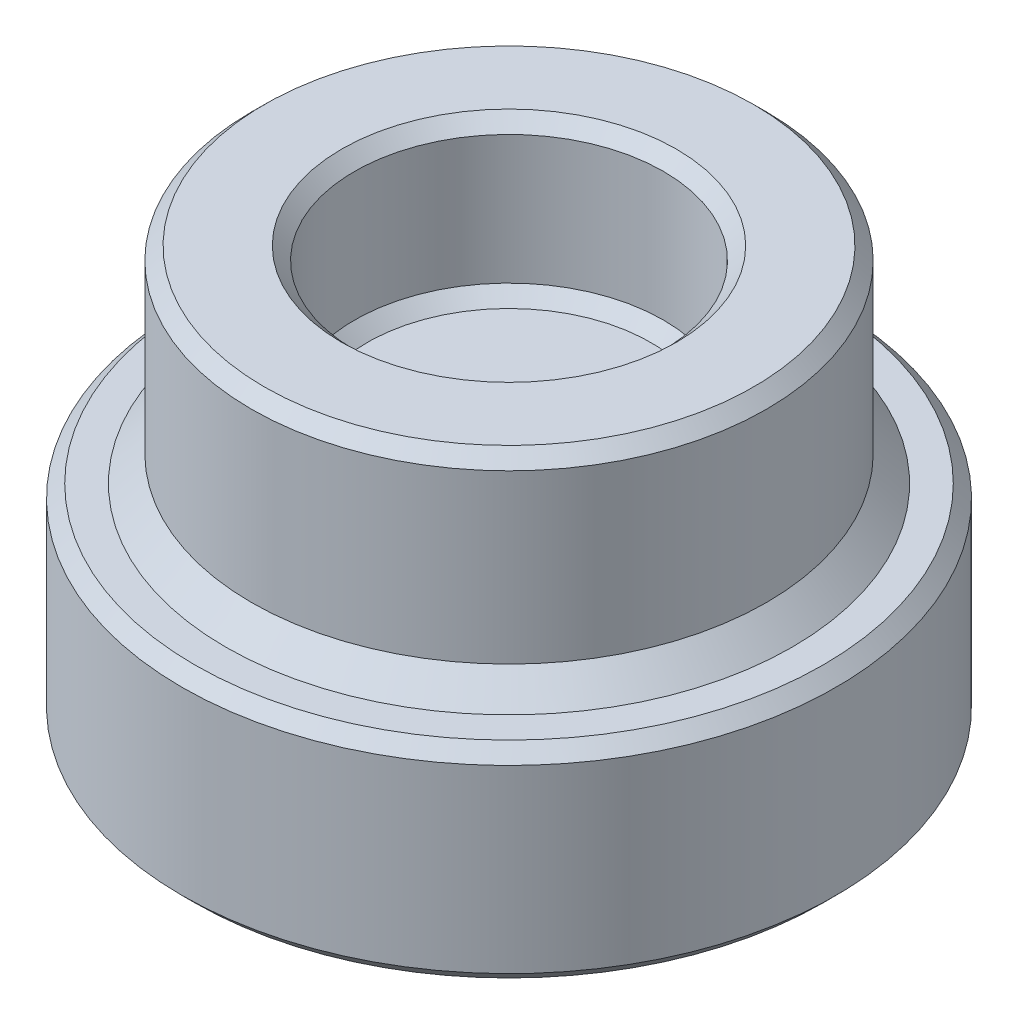
ISO-10303-21;
HEADER;
FILE_DESCRIPTION(('STEP AP214'),'2;1');
FILE_NAME('part.step','',(''),(''),'','','');
FILE_SCHEMA(('AUTOMOTIVE_DESIGN { 1 0 10303 214 1 1 1 1 }'));
ENDSEC;
DATA;
#1=APPLICATION_CONTEXT('core data for automotive mechanical design processes');
#2=APPLICATION_PROTOCOL_DEFINITION('international standard','automotive_design',2000,#1);
#3=PRODUCT_CONTEXT('',#1,'mechanical');
#4=PRODUCT('Part','Part','',(#3));
#5=PRODUCT_RELATED_PRODUCT_CATEGORY('part','',(#4));
#6=PRODUCT_DEFINITION_FORMATION('','',#4);
#7=PRODUCT_DEFINITION_CONTEXT('part definition',#1,'design');
#8=PRODUCT_DEFINITION('design','',#6,#7);
#9=PRODUCT_DEFINITION_SHAPE('','',#8);
#10=(LENGTH_UNIT() NAMED_UNIT(*) SI_UNIT(.MILLI.,.METRE.));
#11=(NAMED_UNIT(*) PLANE_ANGLE_UNIT() SI_UNIT($,.RADIAN.));
#12=(NAMED_UNIT(*) SI_UNIT($,.STERADIAN.) SOLID_ANGLE_UNIT());
#13=UNCERTAINTY_MEASURE_WITH_UNIT(LENGTH_MEASURE(1.E-05),#10,'distance_accuracy_value','');
#14=(GEOMETRIC_REPRESENTATION_CONTEXT(3) GLOBAL_UNCERTAINTY_ASSIGNED_CONTEXT((#13)) GLOBAL_UNIT_ASSIGNED_CONTEXT((#10,
#11,#12)) REPRESENTATION_CONTEXT('',''));
#15=CARTESIAN_POINT('',(0.,0.,0.));
#16=DIRECTION('',(0.,0.,1.));
#17=DIRECTION('',(1.,0.,0.));
#18=AXIS2_PLACEMENT_3D('',#15,#16,#17);
#19=CARTESIAN_POINT('',(0.,1.,0.));
#20=DIRECTION('',(0.,-1.,0.));
#21=DIRECTION('',(0.,0.,-1.));
#22=AXIS2_PLACEMENT_3D('',#19,#20,#21);
#23=CYLINDRICAL_SURFACE('',#22,5.);
#24=CARTESIAN_POINT('',(0.,0.499999999999998,0.));
#25=DIRECTION('',(0.,1.,0.));
#26=DIRECTION('',(0.,0.,1.));
#27=AXIS2_PLACEMENT_3D('',#24,#25,#26);
#28=CIRCLE('',#27,5.);
#29=CARTESIAN_POINT('',(0.,0.499999999999998,5.));
#30=VERTEX_POINT('',#29);
#31=EDGE_CURVE('E76',#30,#30,#28,.T.);
#32=ORIENTED_EDGE('',*,*,#31,.T.);
#33=EDGE_LOOP('',(#32));
#34=FACE_BOUND('',#33,.T.);
#35=CARTESIAN_POINT('',(0.,3.75,0.));
#36=DIRECTION('',(0.,1.,0.));
#37=DIRECTION('',(0.,0.,1.));
#38=AXIS2_PLACEMENT_3D('',#35,#36,#37);
#39=CIRCLE('',#38,5.);
#40=CARTESIAN_POINT('',(0.,3.75,5.));
#41=VERTEX_POINT('',#40);
#42=EDGE_CURVE('E114',#41,#41,#39,.F.);
#43=ORIENTED_EDGE('',*,*,#42,.T.);
#44=EDGE_LOOP('',(#43));
#45=FACE_BOUND('',#44,.T.);
#46=ADVANCED_FACE('F67',(#34,#45),#23,.T.);
#47=CARTESIAN_POINT('',(0.,4.,0.));
#48=DIRECTION('',(0.,1.,0.));
#49=DIRECTION('',(0.,0.,1.));
#50=AXIS2_PLACEMENT_3D('',#47,#48,#49);
#51=PLANE('',#50);
#52=CARTESIAN_POINT('',(0.,4.,0.));
#53=DIRECTION('',(0.,1.,0.));
#54=DIRECTION('',(0.,0.,1.));
#55=AXIS2_PLACEMENT_3D('',#52,#53,#54);
#56=CIRCLE('',#55,3.25);
#57=CARTESIAN_POINT('',(0.,4.,3.25));
#58=VERTEX_POINT('',#57);
#59=EDGE_CURVE('E110',#58,#58,#56,.F.);
#60=ORIENTED_EDGE('',*,*,#59,.T.);
#61=EDGE_LOOP('',(#60));
#62=FACE_BOUND('',#61,.T.);
#63=CARTESIAN_POINT('',(0.,4.,0.));
#64=DIRECTION('',(0.,1.,0.));
#65=DIRECTION('',(0.,0.,1.));
#66=AXIS2_PLACEMENT_3D('',#63,#64,#65);
#67=CIRCLE('',#66,4.75);
#68=CARTESIAN_POINT('',(0.,4.,4.75));
#69=VERTEX_POINT('',#68);
#70=EDGE_CURVE('E106',#69,#69,#67,.T.);
#71=ORIENTED_EDGE('',*,*,#70,.T.);
#72=EDGE_LOOP('',(#71));
#73=FACE_BOUND('',#72,.T.);
#74=ADVANCED_FACE('F154',(#62,#73),#51,.T.);
#75=CARTESIAN_POINT('',(0.,4.,0.));
#76=DIRECTION('',(0.,-1.,0.));
#77=DIRECTION('',(0.,0.,-1.));
#78=AXIS2_PLACEMENT_3D('',#75,#76,#77);
#79=CYLINDRICAL_SURFACE('',#78,3.);
#80=CARTESIAN_POINT('',(0.,3.75,0.));
#81=DIRECTION('',(0.,1.,0.));
#82=DIRECTION('',(0.,0.,1.));
#83=AXIS2_PLACEMENT_3D('',#80,#81,#82);
#84=CIRCLE('',#83,3.);
#85=CARTESIAN_POINT('',(0.,3.75,3.));
#86=VERTEX_POINT('',#85);
#87=EDGE_CURVE('E96',#86,#86,#84,.T.);
#88=ORIENTED_EDGE('',*,*,#87,.T.);
#89=EDGE_LOOP('',(#88));
#90=FACE_BOUND('',#89,.T.);
#91=CARTESIAN_POINT('',(0.,1.25,0.));
#92=DIRECTION('',(0.,1.,0.));
#93=DIRECTION('',(0.,0.,1.));
#94=AXIS2_PLACEMENT_3D('',#91,#92,#93);
#95=CIRCLE('',#94,3.);
#96=CARTESIAN_POINT('',(0.,1.25,3.));
#97=VERTEX_POINT('',#96);
#98=EDGE_CURVE('E90',#97,#97,#95,.F.);
#99=ORIENTED_EDGE('',*,*,#98,.T.);
#100=EDGE_LOOP('',(#99));
#101=FACE_BOUND('',#100,.T.);
#102=ADVANCED_FACE('F159',(#90,#101),#79,.F.);
#103=CARTESIAN_POINT('',(0.,1.,0.));
#104=DIRECTION('',(0.,1.,0.));
#105=DIRECTION('',(0.,0.,1.));
#106=AXIS2_PLACEMENT_3D('',#103,#104,#105);
#107=PLANE('',#106);
#108=CARTESIAN_POINT('',(0.,1.,0.));
#109=DIRECTION('',(0.,1.,0.));
#110=DIRECTION('',(0.,0.,1.));
#111=AXIS2_PLACEMENT_3D('',#108,#109,#110);
#112=CIRCLE('',#111,2.75);
#113=CARTESIAN_POINT('',(0.,1.,2.75));
#114=VERTEX_POINT('',#113);
#115=EDGE_CURVE('E118',#114,#114,#112,.T.);
#116=ORIENTED_EDGE('',*,*,#115,.T.);
#117=EDGE_LOOP('',(#116));
#118=FACE_BOUND('',#117,.T.);
#119=ADVANCED_FACE('F164',(#118),#107,.T.);
#120=CARTESIAN_POINT('',(0.,3.75,0.));
#121=DIRECTION('',(0.,1.,0.));
#122=DIRECTION('',(0.,0.,1.));
#123=AXIS2_PLACEMENT_3D('',#120,#121,#122);
#124=CONICAL_SURFACE('',#123,3.,0.785398163397455);
#125=ORIENTED_EDGE('',*,*,#59,.F.);
#126=EDGE_LOOP('',(#125));
#127=FACE_BOUND('',#126,.T.);
#128=ORIENTED_EDGE('',*,*,#87,.F.);
#129=EDGE_LOOP('',(#128));
#130=FACE_BOUND('',#129,.T.);
#131=ADVANCED_FACE('F166',(#127,#130),#124,.F.);
#132=CARTESIAN_POINT('',(0.,4.,0.));
#133=DIRECTION('',(0.,-1.,0.));
#134=DIRECTION('',(0.,0.,-1.));
#135=AXIS2_PLACEMENT_3D('',#132,#133,#134);
#136=CONICAL_SURFACE('',#135,4.75,0.785398163397441);
#137=ORIENTED_EDGE('',*,*,#42,.F.);
#138=EDGE_LOOP('',(#137));
#139=FACE_BOUND('',#138,.T.);
#140=ORIENTED_EDGE('',*,*,#70,.F.);
#141=EDGE_LOOP('',(#140));
#142=FACE_BOUND('',#141,.T.);
#143=ADVANCED_FACE('F172',(#139,#142),#136,.T.);
#144=CARTESIAN_POINT('',(0.,1.25,0.));
#145=DIRECTION('',(0.,1.,0.));
#146=DIRECTION('',(0.,0.,1.));
#147=AXIS2_PLACEMENT_3D('',#144,#145,#146);
#148=CONICAL_SURFACE('',#147,3.,0.785398163397443);
#149=ORIENTED_EDGE('',*,*,#115,.F.);
#150=EDGE_LOOP('',(#149));
#151=FACE_BOUND('',#150,.T.);
#152=ORIENTED_EDGE('',*,*,#98,.F.);
#153=EDGE_LOOP('',(#152));
#154=FACE_BOUND('',#153,.T.);
#155=ADVANCED_FACE('F179',(#151,#154),#148,.F.);
#156=CARTESIAN_POINT('',(0.,-4.,0.));
#157=DIRECTION('',(0.,1.,0.));
#158=DIRECTION('',(0.,0.,1.));
#159=AXIS2_PLACEMENT_3D('',#156,#157,#158);
#160=CYLINDRICAL_SURFACE('',#159,6.35);
#161=CARTESIAN_POINT('',(0.,-3.75,0.));
#162=DIRECTION('',(0.,1.,0.));
#163=DIRECTION('',(0.,0.,1.));
#164=AXIS2_PLACEMENT_3D('',#161,#162,#163);
#165=CIRCLE('',#164,6.35);
#166=CARTESIAN_POINT('',(0.,-3.75,6.35));
#167=VERTEX_POINT('',#166);
#168=EDGE_CURVE('E126',#167,#167,#165,.T.);
#169=ORIENTED_EDGE('',*,*,#168,.T.);
#170=EDGE_LOOP('',(#169));
#171=FACE_BOUND('',#170,.T.);
#172=CARTESIAN_POINT('',(0.,-0.249999999999996,0.));
#173=DIRECTION('',(0.,1.,0.));
#174=DIRECTION('',(0.,0.,1.));
#175=AXIS2_PLACEMENT_3D('',#172,#173,#174);
#176=CIRCLE('',#175,6.35);
#177=CARTESIAN_POINT('',(0.,-0.249999999999996,6.35));
#178=VERTEX_POINT('',#177);
#179=EDGE_CURVE('E122',#178,#178,#176,.F.);
#180=ORIENTED_EDGE('',*,*,#179,.T.);
#181=EDGE_LOOP('',(#180));
#182=FACE_BOUND('',#181,.T.);
#183=ADVANCED_FACE('F186',(#171,#182),#160,.T.);
#184=CARTESIAN_POINT('',(0.,-4.,0.));
#185=DIRECTION('',(0.,1.,0.));
#186=DIRECTION('',(0.,0.,1.));
#187=AXIS2_PLACEMENT_3D('',#184,#185,#186);
#188=PLANE('',#187);
#189=CARTESIAN_POINT('',(0.,-4.,0.));
#190=DIRECTION('',(0.,1.,0.));
#191=DIRECTION('',(0.,0.,1.));
#192=AXIS2_PLACEMENT_3D('',#189,#190,#191);
#193=CIRCLE('',#192,6.1);
#194=CARTESIAN_POINT('',(0.,-4.,6.1));
#195=VERTEX_POINT('',#194);
#196=EDGE_CURVE('E130',#195,#195,#193,.F.);
#197=ORIENTED_EDGE('',*,*,#196,.T.);
#198=EDGE_LOOP('',(#197));
#199=FACE_BOUND('',#198,.T.);
#200=CARTESIAN_POINT('',(0.,-4.,0.));
#201=DIRECTION('',(0.,-1.,0.));
#202=DIRECTION('',(0.,0.,-1.));
#203=AXIS2_PLACEMENT_3D('',#200,#201,#202);
#204=CIRCLE('',#203,3.125);
#205=CARTESIAN_POINT('',(0.,-4.,-3.125));
#206=VERTEX_POINT('',#205);
#207=EDGE_CURVE('E99',#206,#206,#204,.T.);
#208=ORIENTED_EDGE('',*,*,#207,.F.);
#209=EDGE_LOOP('',(#208));
#210=FACE_BOUND('',#209,.T.);
#211=ADVANCED_FACE('F210',(#199,#210),#188,.F.);
#212=CARTESIAN_POINT('',(0.,0.,0.));
#213=DIRECTION('',(0.,1.,0.));
#214=DIRECTION('',(0.,0.,1.));
#215=AXIS2_PLACEMENT_3D('',#212,#213,#214);
#216=PLANE('',#215);
#217=CARTESIAN_POINT('',(0.,0.,0.));
#218=DIRECTION('',(0.,1.,0.));
#219=DIRECTION('',(0.,0.,1.));
#220=AXIS2_PLACEMENT_3D('',#217,#218,#219);
#221=CIRCLE('',#220,5.49999999999999);
#222=CARTESIAN_POINT('',(0.,0.,5.49999999999999));
#223=VERTEX_POINT('',#222);
#224=EDGE_CURVE('E12',#223,#223,#221,.F.);
#225=ORIENTED_EDGE('',*,*,#224,.T.);
#226=EDGE_LOOP('',(#225));
#227=FACE_BOUND('',#226,.T.);
#228=CARTESIAN_POINT('',(0.,0.,0.));
#229=DIRECTION('',(0.,1.,0.));
#230=DIRECTION('',(0.,0.,1.));
#231=AXIS2_PLACEMENT_3D('',#228,#229,#230);
#232=CIRCLE('',#231,6.1);
#233=CARTESIAN_POINT('',(0.,0.,6.1));
#234=VERTEX_POINT('',#233);
#235=EDGE_CURVE('E134',#234,#234,#232,.T.);
#236=ORIENTED_EDGE('',*,*,#235,.T.);
#237=EDGE_LOOP('',(#236));
#238=FACE_BOUND('',#237,.T.);
#239=ADVANCED_FACE('F83',(#227,#238),#216,.T.);
#240=CARTESIAN_POINT('',(0.,-0.262465990577772,0.));
#241=DIRECTION('',(0.,-1.,0.));
#242=DIRECTION('',(0.,0.,-1.));
#243=AXIS2_PLACEMENT_3D('',#240,#241,#242);
#244=CONICAL_SURFACE('',#243,3.,1.48352986419518);
#245=CARTESIAN_POINT('',(0.,0.,0.));
#246=VERTEX_POINT('',#245);
#247=VERTEX_LOOP('',#246);
#248=FACE_BOUND('',#247,.T.);
#249=CARTESIAN_POINT('',(0.,-0.262465990577772,0.));
#250=DIRECTION('',(0.,-1.,0.));
#251=DIRECTION('',(0.,0.,-1.));
#252=AXIS2_PLACEMENT_3D('',#249,#250,#251);
#253=CIRCLE('',#252,3.);
#254=CARTESIAN_POINT('',(0.,-0.262465990577772,-3.));
#255=VERTEX_POINT('',#254);
#256=EDGE_CURVE('E87',#255,#255,#253,.T.);
#257=ORIENTED_EDGE('',*,*,#256,.T.);
#258=EDGE_LOOP('',(#257));
#259=FACE_BOUND('',#258,.T.);
#260=ADVANCED_FACE('F79',(#248,#259),#244,.F.);
#261=CARTESIAN_POINT('',(0.,-4.,0.));
#262=DIRECTION('',(0.,-1.,0.));
#263=DIRECTION('',(0.,0.,-1.));
#264=AXIS2_PLACEMENT_3D('',#261,#262,#263);
#265=CYLINDRICAL_SURFACE('',#264,3.);
#266=ORIENTED_EDGE('',*,*,#256,.F.);
#267=EDGE_LOOP('',(#266));
#268=FACE_BOUND('',#267,.T.);
#269=CARTESIAN_POINT('',(0.,-3.875,0.));
#270=DIRECTION('',(0.,-1.,0.));
#271=DIRECTION('',(0.,0.,-1.));
#272=AXIS2_PLACEMENT_3D('',#269,#270,#271);
#273=CIRCLE('',#272,3.);
#274=CARTESIAN_POINT('',(0.,-3.875,-3.));
#275=VERTEX_POINT('',#274);
#276=EDGE_CURVE('E91',#275,#275,#273,.T.);
#277=ORIENTED_EDGE('',*,*,#276,.T.);
#278=EDGE_LOOP('',(#277));
#279=FACE_BOUND('',#278,.T.);
#280=ADVANCED_FACE('F82',(#268,#279),#265,.F.);
#281=CARTESIAN_POINT('',(0.,-4.,0.));
#282=DIRECTION('',(0.,-1.,0.));
#283=DIRECTION('',(0.,0.,-1.));
#284=AXIS2_PLACEMENT_3D('',#281,#282,#283);
#285=CONICAL_SURFACE('',#284,3.125,0.785398163397452);
#286=ORIENTED_EDGE('',*,*,#276,.F.);
#287=EDGE_LOOP('',(#286));
#288=FACE_BOUND('',#287,.T.);
#289=ORIENTED_EDGE('',*,*,#207,.T.);
#290=EDGE_LOOP('',(#289));
#291=FACE_BOUND('',#290,.T.);
#292=ADVANCED_FACE('F192',(#288,#291),#285,.F.);
#293=CARTESIAN_POINT('',(0.,-3.75,0.));
#294=DIRECTION('',(0.,1.,0.));
#295=DIRECTION('',(0.,0.,1.));
#296=AXIS2_PLACEMENT_3D('',#293,#294,#295);
#297=CONICAL_SURFACE('',#296,6.35,0.785398163397448);
#298=ORIENTED_EDGE('',*,*,#196,.F.);
#299=EDGE_LOOP('',(#298));
#300=FACE_BOUND('',#299,.T.);
#301=ORIENTED_EDGE('',*,*,#168,.F.);
#302=EDGE_LOOP('',(#301));
#303=FACE_BOUND('',#302,.T.);
#304=ADVANCED_FACE('F150',(#300,#303),#297,.T.);
#305=CARTESIAN_POINT('',(0.,0.,0.));
#306=DIRECTION('',(0.,-1.,0.));
#307=DIRECTION('',(0.,0.,-1.));
#308=AXIS2_PLACEMENT_3D('',#305,#306,#307);
#309=CONICAL_SURFACE('',#308,6.1,0.785398163397453);
#310=ORIENTED_EDGE('',*,*,#179,.F.);
#311=EDGE_LOOP('',(#310));
#312=FACE_BOUND('',#311,.T.);
#313=ORIENTED_EDGE('',*,*,#235,.F.);
#314=EDGE_LOOP('',(#313));
#315=FACE_BOUND('',#314,.T.);
#316=ADVANCED_FACE('F144',(#312,#315),#309,.T.);
#317=CARTESIAN_POINT('',(0.,0.499999999999998,0.));
#318=DIRECTION('',(0.,-1.,0.));
#319=DIRECTION('',(0.,0.,-1.));
#320=AXIS2_PLACEMENT_3D('',#317,#318,#319);
#321=CONICAL_SURFACE('',#320,5.,0.785398163397443);
#322=ORIENTED_EDGE('',*,*,#224,.F.);
#323=EDGE_LOOP('',(#322));
#324=FACE_BOUND('',#323,.T.);
#325=ORIENTED_EDGE('',*,*,#31,.F.);
#326=EDGE_LOOP('',(#325));
#327=FACE_BOUND('',#326,.T.);
#328=ADVANCED_FACE('F70',(#324,#327),#321,.T.);
#329=CLOSED_SHELL('',(#46,#74,#102,#119,#131,#143,#155,#183,#211,#239,#260,#280,#292,#304,#316,#328));
#330=MANIFOLD_SOLID_BREP('B2',#329);
#331=ADVANCED_BREP_SHAPE_REPRESENTATION('',(#18,#330),#14);
#332=SHAPE_DEFINITION_REPRESENTATION(#9,#331);
ENDSEC;
END-ISO-10303-21;
